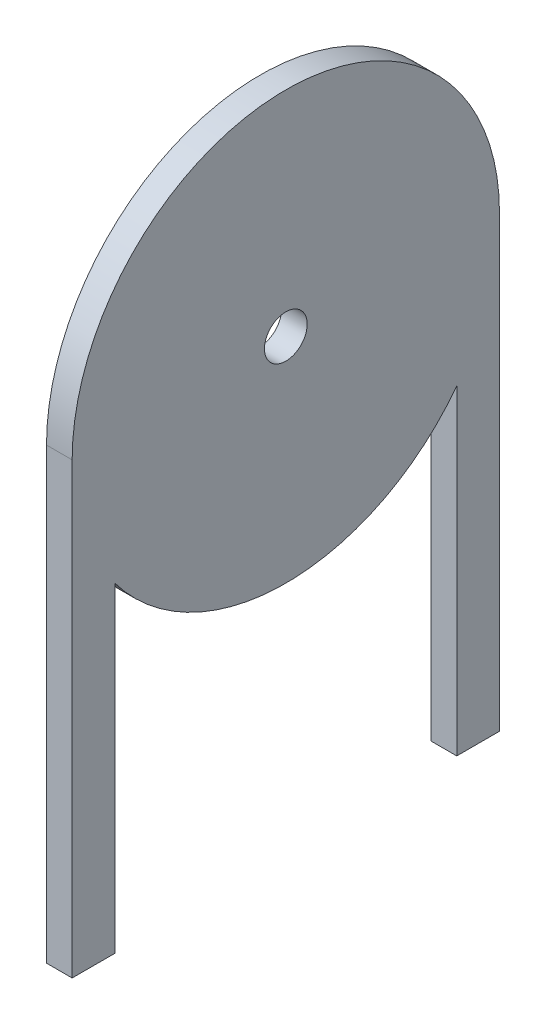
ISO-10303-21;
HEADER;
FILE_DESCRIPTION(('STEP AP214'),'2;1');
FILE_NAME('part.step','',(''),(''),'','','');
FILE_SCHEMA(('AUTOMOTIVE_DESIGN { 1 0 10303 214 1 1 1 1 }'));
ENDSEC;
DATA;
#1=APPLICATION_CONTEXT('core data for automotive mechanical design processes');
#2=APPLICATION_PROTOCOL_DEFINITION('international standard','automotive_design',2000,#1);
#3=PRODUCT_CONTEXT('',#1,'mechanical');
#4=PRODUCT('Part','Part','',(#3));
#5=PRODUCT_RELATED_PRODUCT_CATEGORY('part','',(#4));
#6=PRODUCT_DEFINITION_FORMATION('','',#4);
#7=PRODUCT_DEFINITION_CONTEXT('part definition',#1,'design');
#8=PRODUCT_DEFINITION('design','',#6,#7);
#9=PRODUCT_DEFINITION_SHAPE('','',#8);
#10=(LENGTH_UNIT() NAMED_UNIT(*) SI_UNIT(.MILLI.,.METRE.));
#11=(NAMED_UNIT(*) PLANE_ANGLE_UNIT() SI_UNIT($,.RADIAN.));
#12=(NAMED_UNIT(*) SI_UNIT($,.STERADIAN.) SOLID_ANGLE_UNIT());
#13=UNCERTAINTY_MEASURE_WITH_UNIT(LENGTH_MEASURE(1.E-05),#10,'distance_accuracy_value','');
#14=(GEOMETRIC_REPRESENTATION_CONTEXT(3) GLOBAL_UNCERTAINTY_ASSIGNED_CONTEXT((#13)) GLOBAL_UNIT_ASSIGNED_CONTEXT((#10,
#11,#12)) REPRESENTATION_CONTEXT('',''));
#15=CARTESIAN_POINT('',(0.,0.,0.));
#16=DIRECTION('',(0.,0.,1.));
#17=DIRECTION('',(1.,0.,0.));
#18=AXIS2_PLACEMENT_3D('',#15,#16,#17);
#19=CARTESIAN_POINT('',(3.,0.,20.));
#20=DIRECTION('',(0.,0.,-1.));
#21=DIRECTION('',(-1.,0.,0.));
#22=AXIS2_PLACEMENT_3D('',#19,#20,#21);
#23=PLANE('',#22);
#24=DIRECTION('',(0.,-1.,0.));
#25=VECTOR('',#24,1.);
#26=CARTESIAN_POINT('',(0.,0.,20.));
#27=LINE('',#26,#25);
#28=CARTESIAN_POINT('',(0.,-15.,20.));
#29=VERTEX_POINT('',#28);
#30=CARTESIAN_POINT('',(0.,-52.5,20.));
#31=VERTEX_POINT('',#30);
#32=EDGE_CURVE('E169',#29,#31,#27,.T.);
#33=ORIENTED_EDGE('',*,*,#32,.F.);
#34=DIRECTION('',(-1.,0.,0.));
#35=VECTOR('',#34,1.);
#36=CARTESIAN_POINT('',(3.,-15.,20.));
#37=LINE('',#36,#35);
#38=CARTESIAN_POINT('',(3.,-15.,20.));
#39=VERTEX_POINT('',#38);
#40=EDGE_CURVE('E11',#39,#29,#37,.T.);
#41=ORIENTED_EDGE('',*,*,#40,.F.);
#42=DIRECTION('',(0.,-1.,0.));
#43=VECTOR('',#42,1.);
#44=CARTESIAN_POINT('',(3.,0.,20.));
#45=LINE('',#44,#43);
#46=CARTESIAN_POINT('',(3.,-52.5,20.));
#47=VERTEX_POINT('',#46);
#48=EDGE_CURVE('E131',#39,#47,#45,.T.);
#49=ORIENTED_EDGE('',*,*,#48,.T.);
#50=DIRECTION('',(-1.,0.,0.));
#51=VECTOR('',#50,1.);
#52=CARTESIAN_POINT('',(3.,-52.5,20.));
#53=LINE('',#52,#51);
#54=EDGE_CURVE('E85',#47,#31,#53,.T.);
#55=ORIENTED_EDGE('',*,*,#54,.T.);
#56=EDGE_LOOP('',(#33,#41,#49,#55));
#57=FACE_BOUND('',#56,.T.);
#58=ADVANCED_FACE('F35',(#57),#23,.T.);
#59=CARTESIAN_POINT('',(3.,0.,0.));
#60=DIRECTION('',(-1.,0.,0.));
#61=DIRECTION('',(0.,0.,1.));
#62=AXIS2_PLACEMENT_3D('',#59,#60,#61);
#63=CYLINDRICAL_SURFACE('',#62,25.);
#64=CARTESIAN_POINT('',(0.,0.,0.));
#65=DIRECTION('',(1.,0.,0.));
#66=DIRECTION('',(0.,0.,-1.));
#67=AXIS2_PLACEMENT_3D('',#64,#65,#66);
#68=CIRCLE('',#67,25.);
#69=CARTESIAN_POINT('',(0.,-15.,-20.));
#70=VERTEX_POINT('',#69);
#71=EDGE_CURVE('E163',#70,#29,#68,.F.);
#72=ORIENTED_EDGE('',*,*,#71,.F.);
#73=DIRECTION('',(-1.,0.,0.));
#74=VECTOR('',#73,1.);
#75=CARTESIAN_POINT('',(3.,-15.,-20.));
#76=LINE('',#75,#74);
#77=CARTESIAN_POINT('',(3.,-15.,-20.));
#78=VERTEX_POINT('',#77);
#79=EDGE_CURVE('E43',#78,#70,#76,.T.);
#80=ORIENTED_EDGE('',*,*,#79,.F.);
#81=CARTESIAN_POINT('',(3.,0.,0.));
#82=DIRECTION('',(1.,0.,0.));
#83=DIRECTION('',(0.,0.,-1.));
#84=AXIS2_PLACEMENT_3D('',#81,#82,#83);
#85=CIRCLE('',#84,25.);
#86=EDGE_CURVE('E124',#78,#39,#85,.F.);
#87=ORIENTED_EDGE('',*,*,#86,.T.);
#88=ORIENTED_EDGE('',*,*,#40,.T.);
#89=EDGE_LOOP('',(#72,#80,#87,#88));
#90=FACE_BOUND('',#89,.T.);
#91=ADVANCED_FACE('F168',(#90),#63,.T.);
#92=CARTESIAN_POINT('',(3.,0.,-20.));
#93=DIRECTION('',(0.,0.,-1.));
#94=DIRECTION('',(0.,1.,0.));
#95=AXIS2_PLACEMENT_3D('',#92,#93,#94);
#96=PLANE('',#95);
#97=DIRECTION('',(0.,-1.,0.));
#98=VECTOR('',#97,1.);
#99=CARTESIAN_POINT('',(0.,0.,-20.));
#100=LINE('',#99,#98);
#101=CARTESIAN_POINT('',(0.,-52.5,-20.));
#102=VERTEX_POINT('',#101);
#103=EDGE_CURVE('E156',#70,#102,#100,.T.);
#104=ORIENTED_EDGE('',*,*,#103,.T.);
#105=DIRECTION('',(-1.,0.,0.));
#106=VECTOR('',#105,1.);
#107=CARTESIAN_POINT('',(3.,-52.5,-20.));
#108=LINE('',#107,#106);
#109=CARTESIAN_POINT('',(3.,-52.5,-20.));
#110=VERTEX_POINT('',#109);
#111=EDGE_CURVE('E149',#110,#102,#108,.T.);
#112=ORIENTED_EDGE('',*,*,#111,.F.);
#113=DIRECTION('',(0.,-1.,0.));
#114=VECTOR('',#113,1.);
#115=CARTESIAN_POINT('',(3.,0.,-20.));
#116=LINE('',#115,#114);
#117=EDGE_CURVE('E130',#78,#110,#116,.T.);
#118=ORIENTED_EDGE('',*,*,#117,.F.);
#119=ORIENTED_EDGE('',*,*,#79,.T.);
#120=EDGE_LOOP('',(#104,#112,#118,#119));
#121=FACE_BOUND('',#120,.T.);
#122=ADVANCED_FACE('F154',(#121),#96,.F.);
#123=CARTESIAN_POINT('',(3.,-52.5,0.));
#124=DIRECTION('',(0.,1.,0.));
#125=DIRECTION('',(0.,0.,1.));
#126=AXIS2_PLACEMENT_3D('',#123,#124,#125);
#127=PLANE('',#126);
#128=DIRECTION('',(0.,0.,-1.));
#129=VECTOR('',#128,1.);
#130=CARTESIAN_POINT('',(0.,-52.5,0.));
#131=LINE('',#130,#129);
#132=CARTESIAN_POINT('',(0.,-52.5,-25.));
#133=VERTEX_POINT('',#132);
#134=EDGE_CURVE('E166',#102,#133,#131,.T.);
#135=ORIENTED_EDGE('',*,*,#134,.T.);
#136=DIRECTION('',(-1.,0.,0.));
#137=VECTOR('',#136,1.);
#138=CARTESIAN_POINT('',(3.,-52.5,-25.));
#139=LINE('',#138,#137);
#140=CARTESIAN_POINT('',(3.,-52.5,-25.));
#141=VERTEX_POINT('',#140);
#142=EDGE_CURVE('E147',#141,#133,#139,.T.);
#143=ORIENTED_EDGE('',*,*,#142,.F.);
#144=DIRECTION('',(0.,0.,-1.));
#145=VECTOR('',#144,1.);
#146=CARTESIAN_POINT('',(3.,-52.5,0.));
#147=LINE('',#146,#145);
#148=EDGE_CURVE('E125',#110,#141,#147,.T.);
#149=ORIENTED_EDGE('',*,*,#148,.F.);
#150=ORIENTED_EDGE('',*,*,#111,.T.);
#151=EDGE_LOOP('',(#135,#143,#149,#150));
#152=FACE_BOUND('',#151,.T.);
#153=ADVANCED_FACE('F178',(#152),#127,.F.);
#154=CARTESIAN_POINT('',(3.,0.,-25.));
#155=DIRECTION('',(0.,0.,-1.));
#156=DIRECTION('',(0.,1.,0.));
#157=AXIS2_PLACEMENT_3D('',#154,#155,#156);
#158=PLANE('',#157);
#159=DIRECTION('',(0.,-1.,0.));
#160=VECTOR('',#159,1.);
#161=CARTESIAN_POINT('',(0.,0.,-25.));
#162=LINE('',#161,#160);
#163=CARTESIAN_POINT('',(0.,0.,-25.));
#164=VERTEX_POINT('',#163);
#165=EDGE_CURVE('E172',#164,#133,#162,.T.);
#166=ORIENTED_EDGE('',*,*,#165,.F.);
#167=DIRECTION('',(-1.,0.,0.));
#168=VECTOR('',#167,1.);
#169=CARTESIAN_POINT('',(3.,0.,-25.));
#170=LINE('',#169,#168);
#171=CARTESIAN_POINT('',(3.,0.,-25.));
#172=VERTEX_POINT('',#171);
#173=EDGE_CURVE('E112',#172,#164,#170,.T.);
#174=ORIENTED_EDGE('',*,*,#173,.F.);
#175=DIRECTION('',(0.,-1.,0.));
#176=VECTOR('',#175,1.);
#177=CARTESIAN_POINT('',(3.,0.,-25.));
#178=LINE('',#177,#176);
#179=EDGE_CURVE('E122',#172,#141,#178,.T.);
#180=ORIENTED_EDGE('',*,*,#179,.T.);
#181=ORIENTED_EDGE('',*,*,#142,.T.);
#182=EDGE_LOOP('',(#166,#174,#180,#181));
#183=FACE_BOUND('',#182,.T.);
#184=ADVANCED_FACE('F212',(#183),#158,.T.);
#185=CARTESIAN_POINT('',(0.,0.,25.));
#186=VERTEX_POINT('',#185);
#187=EDGE_CURVE('E111',#186,#164,#68,.F.);
#188=ORIENTED_EDGE('',*,*,#187,.F.);
#189=DIRECTION('',(-1.,0.,0.));
#190=VECTOR('',#189,1.);
#191=CARTESIAN_POINT('',(3.,0.,25.));
#192=LINE('',#191,#190);
#193=CARTESIAN_POINT('',(3.,0.,25.));
#194=VERTEX_POINT('',#193);
#195=EDGE_CURVE('E105',#194,#186,#192,.T.);
#196=ORIENTED_EDGE('',*,*,#195,.F.);
#197=EDGE_CURVE('E109',#194,#172,#85,.F.);
#198=ORIENTED_EDGE('',*,*,#197,.T.);
#199=ORIENTED_EDGE('',*,*,#173,.T.);
#200=EDGE_LOOP('',(#188,#196,#198,#199));
#201=FACE_BOUND('',#200,.T.);
#202=ADVANCED_FACE('F107',(#201),#63,.T.);
#203=CARTESIAN_POINT('',(3.,0.,25.));
#204=DIRECTION('',(0.,0.,-1.));
#205=DIRECTION('',(0.,1.,0.));
#206=AXIS2_PLACEMENT_3D('',#203,#204,#205);
#207=PLANE('',#206);
#208=DIRECTION('',(0.,-1.,0.));
#209=VECTOR('',#208,1.);
#210=CARTESIAN_POINT('',(0.,0.,25.));
#211=LINE('',#210,#209);
#212=CARTESIAN_POINT('',(0.,-52.5,25.));
#213=VERTEX_POINT('',#212);
#214=EDGE_CURVE('E78',#186,#213,#211,.T.);
#215=ORIENTED_EDGE('',*,*,#214,.T.);
#216=DIRECTION('',(-1.,0.,0.));
#217=VECTOR('',#216,1.);
#218=CARTESIAN_POINT('',(3.,-52.5,25.));
#219=LINE('',#218,#217);
#220=CARTESIAN_POINT('',(3.,-52.5,25.));
#221=VERTEX_POINT('',#220);
#222=EDGE_CURVE('E113',#221,#213,#219,.T.);
#223=ORIENTED_EDGE('',*,*,#222,.F.);
#224=DIRECTION('',(0.,-1.,0.));
#225=VECTOR('',#224,1.);
#226=CARTESIAN_POINT('',(3.,0.,25.));
#227=LINE('',#226,#225);
#228=EDGE_CURVE('E115',#194,#221,#227,.T.);
#229=ORIENTED_EDGE('',*,*,#228,.F.);
#230=ORIENTED_EDGE('',*,*,#195,.T.);
#231=EDGE_LOOP('',(#215,#223,#229,#230));
#232=FACE_BOUND('',#231,.T.);
#233=ADVANCED_FACE('F116',(#232),#207,.F.);
#234=CARTESIAN_POINT('',(3.,-52.5,0.));
#235=DIRECTION('',(0.,1.,0.));
#236=DIRECTION('',(0.,0.,1.));
#237=AXIS2_PLACEMENT_3D('',#234,#235,#236);
#238=PLANE('',#237);
#239=DIRECTION('',(0.,0.,-1.));
#240=VECTOR('',#239,1.);
#241=CARTESIAN_POINT('',(0.,-52.5,0.));
#242=LINE('',#241,#240);
#243=EDGE_CURVE('E136',#213,#31,#242,.T.);
#244=ORIENTED_EDGE('',*,*,#243,.T.);
#245=ORIENTED_EDGE('',*,*,#54,.F.);
#246=DIRECTION('',(0.,0.,-1.));
#247=VECTOR('',#246,1.);
#248=CARTESIAN_POINT('',(3.,-52.5,0.));
#249=LINE('',#248,#247);
#250=EDGE_CURVE('E51',#221,#47,#249,.T.);
#251=ORIENTED_EDGE('',*,*,#250,.F.);
#252=ORIENTED_EDGE('',*,*,#222,.T.);
#253=EDGE_LOOP('',(#244,#245,#251,#252));
#254=FACE_BOUND('',#253,.T.);
#255=ADVANCED_FACE('F195',(#254),#238,.F.);
#256=CARTESIAN_POINT('',(3.,0.,0.));
#257=DIRECTION('',(-1.,0.,0.));
#258=DIRECTION('',(0.,0.,1.));
#259=AXIS2_PLACEMENT_3D('',#256,#257,#258);
#260=CYLINDRICAL_SURFACE('',#259,2.5);
#261=CARTESIAN_POINT('',(3.,0.,0.));
#262=DIRECTION('',(1.,0.,0.));
#263=DIRECTION('',(0.,0.,-1.));
#264=AXIS2_PLACEMENT_3D('',#261,#262,#263);
#265=CIRCLE('',#264,2.5);
#266=CARTESIAN_POINT('',(3.,0.,-2.5));
#267=VERTEX_POINT('',#266);
#268=EDGE_CURVE('E144',#267,#267,#265,.T.);
#269=ORIENTED_EDGE('',*,*,#268,.T.);
#270=EDGE_LOOP('',(#269));
#271=FACE_BOUND('',#270,.T.);
#272=CARTESIAN_POINT('',(0.,0.,0.));
#273=DIRECTION('',(1.,0.,0.));
#274=DIRECTION('',(0.,0.,-1.));
#275=AXIS2_PLACEMENT_3D('',#272,#273,#274);
#276=CIRCLE('',#275,2.5);
#277=CARTESIAN_POINT('',(0.,0.,-2.5));
#278=VERTEX_POINT('',#277);
#279=EDGE_CURVE('E134',#278,#278,#276,.T.);
#280=ORIENTED_EDGE('',*,*,#279,.F.);
#281=EDGE_LOOP('',(#280));
#282=FACE_BOUND('',#281,.T.);
#283=ADVANCED_FACE('F186',(#271,#282),#260,.F.);
#284=CARTESIAN_POINT('',(3.,0.,0.));
#285=DIRECTION('',(1.,0.,0.));
#286=DIRECTION('',(0.,0.,-1.));
#287=AXIS2_PLACEMENT_3D('',#284,#285,#286);
#288=PLANE('',#287);
#289=ORIENTED_EDGE('',*,*,#48,.F.);
#290=ORIENTED_EDGE('',*,*,#86,.F.);
#291=ORIENTED_EDGE('',*,*,#117,.T.);
#292=ORIENTED_EDGE('',*,*,#148,.T.);
#293=ORIENTED_EDGE('',*,*,#179,.F.);
#294=ORIENTED_EDGE('',*,*,#197,.F.);
#295=ORIENTED_EDGE('',*,*,#228,.T.);
#296=ORIENTED_EDGE('',*,*,#250,.T.);
#297=EDGE_LOOP('',(#289,#290,#291,#292,#293,#294,#295,#296));
#298=FACE_BOUND('',#297,.T.);
#299=ORIENTED_EDGE('',*,*,#268,.F.);
#300=EDGE_LOOP('',(#299));
#301=FACE_BOUND('',#300,.T.);
#302=ADVANCED_FACE('F119',(#298,#301),#288,.T.);
#303=CARTESIAN_POINT('',(0.,0.,0.));
#304=DIRECTION('',(1.,0.,0.));
#305=DIRECTION('',(0.,0.,-1.));
#306=AXIS2_PLACEMENT_3D('',#303,#304,#305);
#307=PLANE('',#306);
#308=ORIENTED_EDGE('',*,*,#32,.T.);
#309=ORIENTED_EDGE('',*,*,#243,.F.);
#310=ORIENTED_EDGE('',*,*,#214,.F.);
#311=ORIENTED_EDGE('',*,*,#187,.T.);
#312=ORIENTED_EDGE('',*,*,#165,.T.);
#313=ORIENTED_EDGE('',*,*,#134,.F.);
#314=ORIENTED_EDGE('',*,*,#103,.F.);
#315=ORIENTED_EDGE('',*,*,#71,.T.);
#316=EDGE_LOOP('',(#308,#309,#310,#311,#312,#313,#314,#315));
#317=FACE_BOUND('',#316,.T.);
#318=ORIENTED_EDGE('',*,*,#279,.T.);
#319=EDGE_LOOP('',(#318));
#320=FACE_BOUND('',#319,.T.);
#321=ADVANCED_FACE('F162',(#317,#320),#307,.F.);
#322=CLOSED_SHELL('',(#58,#91,#122,#153,#184,#202,#233,#255,#283,#302,#321));
#323=MANIFOLD_SOLID_BREP('B2',#322);
#324=ADVANCED_BREP_SHAPE_REPRESENTATION('',(#18,#323),#14);
#325=SHAPE_DEFINITION_REPRESENTATION(#9,#324);
ENDSEC;
END-ISO-10303-21;
